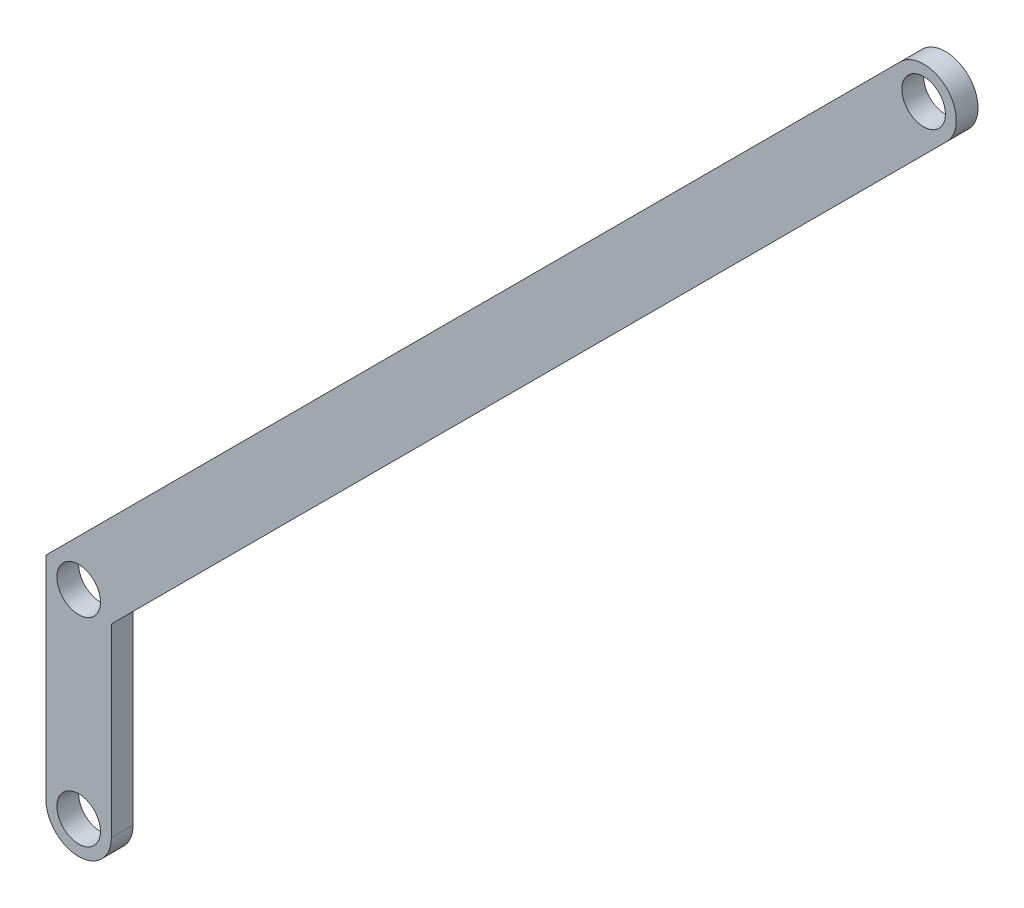
ISO-10303-21;
HEADER;
FILE_DESCRIPTION(('STEP AP214'),'2;1');
FILE_NAME('part.step','',(''),(''),'','','');
FILE_SCHEMA(('AUTOMOTIVE_DESIGN { 1 0 10303 214 1 1 1 1 }'));
ENDSEC;
DATA;
#1=APPLICATION_CONTEXT('core data for automotive mechanical design processes');
#2=APPLICATION_PROTOCOL_DEFINITION('international standard','automotive_design',2000,#1);
#3=PRODUCT_CONTEXT('',#1,'mechanical');
#4=PRODUCT('Part','Part','',(#3));
#5=PRODUCT_RELATED_PRODUCT_CATEGORY('part','',(#4));
#6=PRODUCT_DEFINITION_FORMATION('','',#4);
#7=PRODUCT_DEFINITION_CONTEXT('part definition',#1,'design');
#8=PRODUCT_DEFINITION('design','',#6,#7);
#9=PRODUCT_DEFINITION_SHAPE('','',#8);
#10=(LENGTH_UNIT() NAMED_UNIT(*) SI_UNIT(.MILLI.,.METRE.));
#11=(NAMED_UNIT(*) PLANE_ANGLE_UNIT() SI_UNIT($,.RADIAN.));
#12=(NAMED_UNIT(*) SI_UNIT($,.STERADIAN.) SOLID_ANGLE_UNIT());
#13=UNCERTAINTY_MEASURE_WITH_UNIT(LENGTH_MEASURE(1.E-05),#10,'distance_accuracy_value','');
#14=(GEOMETRIC_REPRESENTATION_CONTEXT(3) GLOBAL_UNCERTAINTY_ASSIGNED_CONTEXT((#13)) GLOBAL_UNIT_ASSIGNED_CONTEXT((#10,
#11,#12)) REPRESENTATION_CONTEXT('',''));
#15=CARTESIAN_POINT('',(0.,0.,0.));
#16=DIRECTION('',(0.,0.,1.));
#17=DIRECTION('',(1.,0.,0.));
#18=AXIS2_PLACEMENT_3D('',#15,#16,#17);
#19=CARTESIAN_POINT('',(0.,0.,5.));
#20=DIRECTION('',(0.,0.,1.));
#21=DIRECTION('',(1.,0.,0.));
#22=AXIS2_PLACEMENT_3D('',#19,#20,#21);
#23=PLANE('',#22);
#24=CARTESIAN_POINT('',(-90.2711107063705,11.7154442724582,5.));
#25=DIRECTION('',(0.,0.,1.));
#26=DIRECTION('',(1.,0.,0.));
#27=AXIS2_PLACEMENT_3D('',#24,#25,#26);
#28=CIRCLE('',#27,5.);
#29=CARTESIAN_POINT('',(-85.2711107063705,11.7154442724582,5.));
#30=VERTEX_POINT('',#29);
#31=EDGE_CURVE('E206',#30,#30,#28,.T.);
#32=ORIENTED_EDGE('',*,*,#31,.F.);
#33=EDGE_LOOP('',(#32));
#34=FACE_BOUND('',#33,.T.);
#35=CARTESIAN_POINT('',(-90.2711107063705,-33.89115744534,5.));
#36=DIRECTION('',(0.,0.,1.));
#37=DIRECTION('',(1.,0.,0.));
#38=AXIS2_PLACEMENT_3D('',#35,#36,#37);
#39=CIRCLE('',#38,5.00000000000001);
#40=CARTESIAN_POINT('',(-85.2711107063705,-33.89115744534,5.));
#41=VERTEX_POINT('',#40);
#42=EDGE_CURVE('E186',#41,#41,#39,.T.);
#43=ORIENTED_EDGE('',*,*,#42,.F.);
#44=EDGE_LOOP('',(#43));
#45=FACE_BOUND('',#44,.T.);
#46=CARTESIAN_POINT('',(103.754321931796,205.740876910624,5.));
#47=DIRECTION('',(0.,0.,1.));
#48=DIRECTION('',(1.,0.,0.));
#49=AXIS2_PLACEMENT_3D('',#46,#47,#48);
#50=CIRCLE('',#49,5.00000000000001);
#51=CARTESIAN_POINT('',(108.754321931796,205.740876910624,5.));
#52=VERTEX_POINT('',#51);
#53=EDGE_CURVE('E171',#52,#52,#50,.T.);
#54=ORIENTED_EDGE('',*,*,#53,.F.);
#55=EDGE_LOOP('',(#54));
#56=FACE_BOUND('',#55,.T.);
#57=DIRECTION('',(0.707106781186549,0.707106781186546,0.));
#58=VECTOR('',#57,1.);
#59=CARTESIAN_POINT('',(-82.7711107063705,8.60884255466003,5.));
#60=LINE('',#59,#58);
#61=CARTESIAN_POINT('',(-82.7711107063705,8.60884255466003,5.));
#62=VERTEX_POINT('',#61);
#63=CARTESIAN_POINT('',(109.057622790695,200.437576051725,5.));
#64=VERTEX_POINT('',#63);
#65=EDGE_CURVE('E138',#62,#64,#60,.T.);
#66=ORIENTED_EDGE('',*,*,#65,.T.);
#67=CARTESIAN_POINT('',(103.754321931796,205.740876910624,5.));
#68=DIRECTION('',(0.,0.,1.));
#69=DIRECTION('',(1.,0.,0.));
#70=AXIS2_PLACEMENT_3D('',#67,#68,#69);
#71=CIRCLE('',#70,7.50000000000001);
#72=CARTESIAN_POINT('',(98.4510210728969,211.044177769523,5.));
#73=VERTEX_POINT('',#72);
#74=EDGE_CURVE('E172',#64,#73,#71,.T.);
#75=ORIENTED_EDGE('',*,*,#74,.T.);
#76=DIRECTION('',(-0.707106781186549,-0.707106781186546,0.));
#77=VECTOR('',#76,1.);
#78=CARTESIAN_POINT('',(-97.7711107063705,14.8220459902565,5.));
#79=LINE('',#78,#77);
#80=CARTESIAN_POINT('',(-97.7711107063705,14.8220459902565,5.));
#81=VERTEX_POINT('',#80);
#82=EDGE_CURVE('E147',#73,#81,#79,.T.);
#83=ORIENTED_EDGE('',*,*,#82,.T.);
#84=DIRECTION('',(0.,-1.,0.));
#85=VECTOR('',#84,1.);
#86=CARTESIAN_POINT('',(-97.7711107063705,14.8220459902565,5.));
#87=LINE('',#86,#85);
#88=CARTESIAN_POINT('',(-97.7711107063705,-33.89115744534,5.));
#89=VERTEX_POINT('',#88);
#90=EDGE_CURVE('E150',#81,#89,#87,.T.);
#91=ORIENTED_EDGE('',*,*,#90,.T.);
#92=CARTESIAN_POINT('',(-90.2711107063705,-33.89115744534,5.));
#93=DIRECTION('',(0.,0.,1.));
#94=DIRECTION('',(1.,0.,0.));
#95=AXIS2_PLACEMENT_3D('',#92,#93,#94);
#96=CIRCLE('',#95,7.50000000000001);
#97=CARTESIAN_POINT('',(-82.7711107063705,-33.89115744534,5.));
#98=VERTEX_POINT('',#97);
#99=EDGE_CURVE('E185',#89,#98,#96,.T.);
#100=ORIENTED_EDGE('',*,*,#99,.T.);
#101=DIRECTION('',(0.,1.,0.));
#102=VECTOR('',#101,1.);
#103=CARTESIAN_POINT('',(-82.7711107063705,-41.39115744534,5.));
#104=LINE('',#103,#102);
#105=EDGE_CURVE('E106',#98,#62,#104,.T.);
#106=ORIENTED_EDGE('',*,*,#105,.T.);
#107=EDGE_LOOP('',(#66,#75,#83,#91,#100,#106));
#108=FACE_BOUND('',#107,.T.);
#109=ADVANCED_FACE('F81',(#34,#45,#56,#108),#23,.T.);
#110=CARTESIAN_POINT('',(0.,0.,0.));
#111=DIRECTION('',(0.,0.,1.));
#112=DIRECTION('',(1.,0.,0.));
#113=AXIS2_PLACEMENT_3D('',#110,#111,#112);
#114=PLANE('',#113);
#115=CARTESIAN_POINT('',(-90.2711107063705,11.7154442724582,0.));
#116=DIRECTION('',(0.,0.,1.));
#117=DIRECTION('',(1.,0.,0.));
#118=AXIS2_PLACEMENT_3D('',#115,#116,#117);
#119=CIRCLE('',#118,5.);
#120=CARTESIAN_POINT('',(-85.2711107063705,11.7154442724582,0.));
#121=VERTEX_POINT('',#120);
#122=EDGE_CURVE('E205',#121,#121,#119,.T.);
#123=ORIENTED_EDGE('',*,*,#122,.T.);
#124=EDGE_LOOP('',(#123));
#125=FACE_BOUND('',#124,.T.);
#126=CARTESIAN_POINT('',(103.754321931796,205.740876910624,0.));
#127=DIRECTION('',(0.,0.,1.));
#128=DIRECTION('',(1.,0.,0.));
#129=AXIS2_PLACEMENT_3D('',#126,#127,#128);
#130=CIRCLE('',#129,5.00000000000001);
#131=CARTESIAN_POINT('',(108.754321931796,205.740876910624,0.));
#132=VERTEX_POINT('',#131);
#133=EDGE_CURVE('E181',#132,#132,#130,.T.);
#134=ORIENTED_EDGE('',*,*,#133,.T.);
#135=EDGE_LOOP('',(#134));
#136=FACE_BOUND('',#135,.T.);
#137=CARTESIAN_POINT('',(-90.2711107063705,-33.89115744534,0.));
#138=DIRECTION('',(0.,0.,1.));
#139=DIRECTION('',(1.,0.,0.));
#140=AXIS2_PLACEMENT_3D('',#137,#138,#139);
#141=CIRCLE('',#140,5.00000000000001);
#142=CARTESIAN_POINT('',(-85.2711107063705,-33.89115744534,0.));
#143=VERTEX_POINT('',#142);
#144=EDGE_CURVE('E159',#143,#143,#141,.T.);
#145=ORIENTED_EDGE('',*,*,#144,.T.);
#146=EDGE_LOOP('',(#145));
#147=FACE_BOUND('',#146,.T.);
#148=CARTESIAN_POINT('',(103.754321931796,205.740876910624,0.));
#149=DIRECTION('',(0.,0.,1.));
#150=DIRECTION('',(1.,0.,0.));
#151=AXIS2_PLACEMENT_3D('',#148,#149,#150);
#152=CIRCLE('',#151,7.50000000000001);
#153=CARTESIAN_POINT('',(109.057622790695,200.437576051725,0.));
#154=VERTEX_POINT('',#153);
#155=CARTESIAN_POINT('',(98.4510210728969,211.044177769523,0.));
#156=VERTEX_POINT('',#155);
#157=EDGE_CURVE('E144',#154,#156,#152,.T.);
#158=ORIENTED_EDGE('',*,*,#157,.F.);
#159=DIRECTION('',(0.707106781186549,0.707106781186546,0.));
#160=VECTOR('',#159,1.);
#161=CARTESIAN_POINT('',(-82.7711107063705,8.60884255466003,0.));
#162=LINE('',#161,#160);
#163=CARTESIAN_POINT('',(-82.7711107063705,8.60884255466003,0.));
#164=VERTEX_POINT('',#163);
#165=EDGE_CURVE('E130',#164,#154,#162,.T.);
#166=ORIENTED_EDGE('',*,*,#165,.F.);
#167=DIRECTION('',(0.,1.,0.));
#168=VECTOR('',#167,1.);
#169=CARTESIAN_POINT('',(-82.7711107063705,-41.39115744534,0.));
#170=LINE('',#169,#168);
#171=CARTESIAN_POINT('',(-82.7711107063705,-33.89115744534,0.));
#172=VERTEX_POINT('',#171);
#173=EDGE_CURVE('E120',#172,#164,#170,.T.);
#174=ORIENTED_EDGE('',*,*,#173,.F.);
#175=CARTESIAN_POINT('',(-90.2711107063705,-33.89115744534,0.));
#176=DIRECTION('',(0.,0.,1.));
#177=DIRECTION('',(1.,0.,0.));
#178=AXIS2_PLACEMENT_3D('',#175,#176,#177);
#179=CIRCLE('',#178,7.50000000000001);
#180=CARTESIAN_POINT('',(-97.7711107063705,-33.89115744534,0.));
#181=VERTEX_POINT('',#180);
#182=EDGE_CURVE('E195',#181,#172,#179,.T.);
#183=ORIENTED_EDGE('',*,*,#182,.F.);
#184=DIRECTION('',(0.,-1.,0.));
#185=VECTOR('',#184,1.);
#186=CARTESIAN_POINT('',(-97.7711107063705,14.8220459902565,0.));
#187=LINE('',#186,#185);
#188=CARTESIAN_POINT('',(-97.7711107063705,14.8220459902565,0.));
#189=VERTEX_POINT('',#188);
#190=EDGE_CURVE('E131',#189,#181,#187,.T.);
#191=ORIENTED_EDGE('',*,*,#190,.F.);
#192=DIRECTION('',(-0.707106781186549,-0.707106781186546,0.));
#193=VECTOR('',#192,1.);
#194=CARTESIAN_POINT('',(-97.7711107063705,14.8220459902565,0.));
#195=LINE('',#194,#193);
#196=EDGE_CURVE('E156',#156,#189,#195,.T.);
#197=ORIENTED_EDGE('',*,*,#196,.F.);
#198=EDGE_LOOP('',(#158,#166,#174,#183,#191,#197));
#199=FACE_BOUND('',#198,.T.);
#200=ADVANCED_FACE('F141',(#125,#136,#147,#199),#114,.F.);
#201=CARTESIAN_POINT('',(-82.7711107063705,-41.39115744534,5.));
#202=DIRECTION('',(-1.,0.,0.));
#203=DIRECTION('',(0.,0.,1.));
#204=AXIS2_PLACEMENT_3D('',#201,#202,#203);
#205=PLANE('',#204);
#206=DIRECTION('',(0.,0.,1.));
#207=VECTOR('',#206,1.);
#208=CARTESIAN_POINT('',(-82.7711107063705,-33.89115744534,0.));
#209=LINE('',#208,#207);
#210=EDGE_CURVE('E126',#172,#98,#209,.T.);
#211=ORIENTED_EDGE('',*,*,#210,.F.);
#212=ORIENTED_EDGE('',*,*,#173,.T.);
#213=DIRECTION('',(0.,0.,-1.));
#214=VECTOR('',#213,1.);
#215=CARTESIAN_POINT('',(-82.7711107063705,8.60884255466003,5.));
#216=LINE('',#215,#214);
#217=EDGE_CURVE('E90',#62,#164,#216,.T.);
#218=ORIENTED_EDGE('',*,*,#217,.F.);
#219=ORIENTED_EDGE('',*,*,#105,.F.);
#220=EDGE_LOOP('',(#211,#212,#218,#219));
#221=FACE_BOUND('',#220,.T.);
#222=ADVANCED_FACE('F122',(#221),#205,.F.);
#223=CARTESIAN_POINT('',(-97.7711107063705,14.8220459902565,5.));
#224=DIRECTION('',(0.707106781186546,-0.707106781186549,0.));
#225=DIRECTION('',(0.707106781186549,0.707106781186546,0.));
#226=AXIS2_PLACEMENT_3D('',#223,#224,#225);
#227=PLANE('',#226);
#228=DIRECTION('',(0.,0.,1.));
#229=VECTOR('',#228,1.);
#230=CARTESIAN_POINT('',(98.4510210728969,211.044177769523,0.));
#231=LINE('',#230,#229);
#232=EDGE_CURVE('E167',#156,#73,#231,.T.);
#233=ORIENTED_EDGE('',*,*,#232,.F.);
#234=ORIENTED_EDGE('',*,*,#196,.T.);
#235=DIRECTION('',(0.,0.,-1.));
#236=VECTOR('',#235,1.);
#237=CARTESIAN_POINT('',(-97.7711107063705,14.8220459902565,5.));
#238=LINE('',#237,#236);
#239=EDGE_CURVE('E12',#81,#189,#238,.T.);
#240=ORIENTED_EDGE('',*,*,#239,.F.);
#241=ORIENTED_EDGE('',*,*,#82,.F.);
#242=EDGE_LOOP('',(#233,#234,#240,#241));
#243=FACE_BOUND('',#242,.T.);
#244=ADVANCED_FACE('F83',(#243),#227,.F.);
#245=CARTESIAN_POINT('',(-97.7711107063705,14.8220459902565,5.));
#246=DIRECTION('',(1.,0.,0.));
#247=DIRECTION('',(0.,0.,-1.));
#248=AXIS2_PLACEMENT_3D('',#245,#246,#247);
#249=PLANE('',#248);
#250=ORIENTED_EDGE('',*,*,#190,.T.);
#251=DIRECTION('',(0.,0.,1.));
#252=VECTOR('',#251,1.);
#253=CARTESIAN_POINT('',(-97.7711107063705,-33.89115744534,0.));
#254=LINE('',#253,#252);
#255=EDGE_CURVE('E97',#181,#89,#254,.T.);
#256=ORIENTED_EDGE('',*,*,#255,.T.);
#257=ORIENTED_EDGE('',*,*,#90,.F.);
#258=ORIENTED_EDGE('',*,*,#239,.T.);
#259=EDGE_LOOP('',(#250,#256,#257,#258));
#260=FACE_BOUND('',#259,.T.);
#261=ADVANCED_FACE('F249',(#260),#249,.F.);
#262=CARTESIAN_POINT('',(-82.7711107063705,8.60884255466003,5.));
#263=DIRECTION('',(-0.707106781186546,0.707106781186549,0.));
#264=DIRECTION('',(-0.707106781186549,-0.707106781186546,0.));
#265=AXIS2_PLACEMENT_3D('',#262,#263,#264);
#266=PLANE('',#265);
#267=ORIENTED_EDGE('',*,*,#165,.T.);
#268=DIRECTION('',(0.,0.,1.));
#269=VECTOR('',#268,1.);
#270=CARTESIAN_POINT('',(109.057622790695,200.437576051725,0.));
#271=LINE('',#270,#269);
#272=EDGE_CURVE('E202',#154,#64,#271,.T.);
#273=ORIENTED_EDGE('',*,*,#272,.T.);
#274=ORIENTED_EDGE('',*,*,#65,.F.);
#275=ORIENTED_EDGE('',*,*,#217,.T.);
#276=EDGE_LOOP('',(#267,#273,#274,#275));
#277=FACE_BOUND('',#276,.T.);
#278=ADVANCED_FACE('F135',(#277),#266,.F.);
#279=CARTESIAN_POINT('',(103.754321931796,205.740876910624,0.));
#280=DIRECTION('',(0.,0.,1.));
#281=DIRECTION('',(1.,0.,0.));
#282=AXIS2_PLACEMENT_3D('',#279,#280,#281);
#283=CYLINDRICAL_SURFACE('',#282,7.50000000000001);
#284=ORIENTED_EDGE('',*,*,#74,.F.);
#285=ORIENTED_EDGE('',*,*,#272,.F.);
#286=ORIENTED_EDGE('',*,*,#157,.T.);
#287=ORIENTED_EDGE('',*,*,#232,.T.);
#288=EDGE_LOOP('',(#284,#285,#286,#287));
#289=FACE_BOUND('',#288,.T.);
#290=ADVANCED_FACE('F243',(#289),#283,.T.);
#291=CARTESIAN_POINT('',(103.754321931796,205.740876910624,0.));
#292=DIRECTION('',(0.,0.,1.));
#293=DIRECTION('',(1.,0.,0.));
#294=AXIS2_PLACEMENT_3D('',#291,#292,#293);
#295=CYLINDRICAL_SURFACE('',#294,5.00000000000001);
#296=ORIENTED_EDGE('',*,*,#133,.F.);
#297=EDGE_LOOP('',(#296));
#298=FACE_BOUND('',#297,.T.);
#299=ORIENTED_EDGE('',*,*,#53,.T.);
#300=EDGE_LOOP('',(#299));
#301=FACE_BOUND('',#300,.T.);
#302=ADVANCED_FACE('F256',(#298,#301),#295,.F.);
#303=CARTESIAN_POINT('',(-90.2711107063705,-33.89115744534,0.));
#304=DIRECTION('',(0.,0.,1.));
#305=DIRECTION('',(1.,0.,0.));
#306=AXIS2_PLACEMENT_3D('',#303,#304,#305);
#307=CYLINDRICAL_SURFACE('',#306,5.00000000000001);
#308=ORIENTED_EDGE('',*,*,#144,.F.);
#309=EDGE_LOOP('',(#308));
#310=FACE_BOUND('',#309,.T.);
#311=ORIENTED_EDGE('',*,*,#42,.T.);
#312=EDGE_LOOP('',(#311));
#313=FACE_BOUND('',#312,.T.);
#314=ADVANCED_FACE('F251',(#310,#313),#307,.F.);
#315=CARTESIAN_POINT('',(-90.2711107063705,-33.89115744534,0.));
#316=DIRECTION('',(0.,0.,1.));
#317=DIRECTION('',(1.,0.,0.));
#318=AXIS2_PLACEMENT_3D('',#315,#316,#317);
#319=CYLINDRICAL_SURFACE('',#318,7.50000000000001);
#320=ORIENTED_EDGE('',*,*,#99,.F.);
#321=ORIENTED_EDGE('',*,*,#255,.F.);
#322=ORIENTED_EDGE('',*,*,#182,.T.);
#323=ORIENTED_EDGE('',*,*,#210,.T.);
#324=EDGE_LOOP('',(#320,#321,#322,#323));
#325=FACE_BOUND('',#324,.T.);
#326=ADVANCED_FACE('F219',(#325),#319,.T.);
#327=CARTESIAN_POINT('',(-90.2711107063705,11.7154442724582,0.));
#328=DIRECTION('',(0.,0.,1.));
#329=DIRECTION('',(1.,0.,0.));
#330=AXIS2_PLACEMENT_3D('',#327,#328,#329);
#331=CYLINDRICAL_SURFACE('',#330,5.);
#332=ORIENTED_EDGE('',*,*,#122,.F.);
#333=EDGE_LOOP('',(#332));
#334=FACE_BOUND('',#333,.T.);
#335=ORIENTED_EDGE('',*,*,#31,.T.);
#336=EDGE_LOOP('',(#335));
#337=FACE_BOUND('',#336,.T.);
#338=ADVANCED_FACE('F216',(#334,#337),#331,.F.);
#339=CLOSED_SHELL('',(#109,#200,#222,#244,#261,#278,#290,#302,#314,#326,#338));
#340=MANIFOLD_SOLID_BREP('B2',#339);
#341=ADVANCED_BREP_SHAPE_REPRESENTATION('',(#18,#340),#14);
#342=SHAPE_DEFINITION_REPRESENTATION(#9,#341);
ENDSEC;
END-ISO-10303-21;
